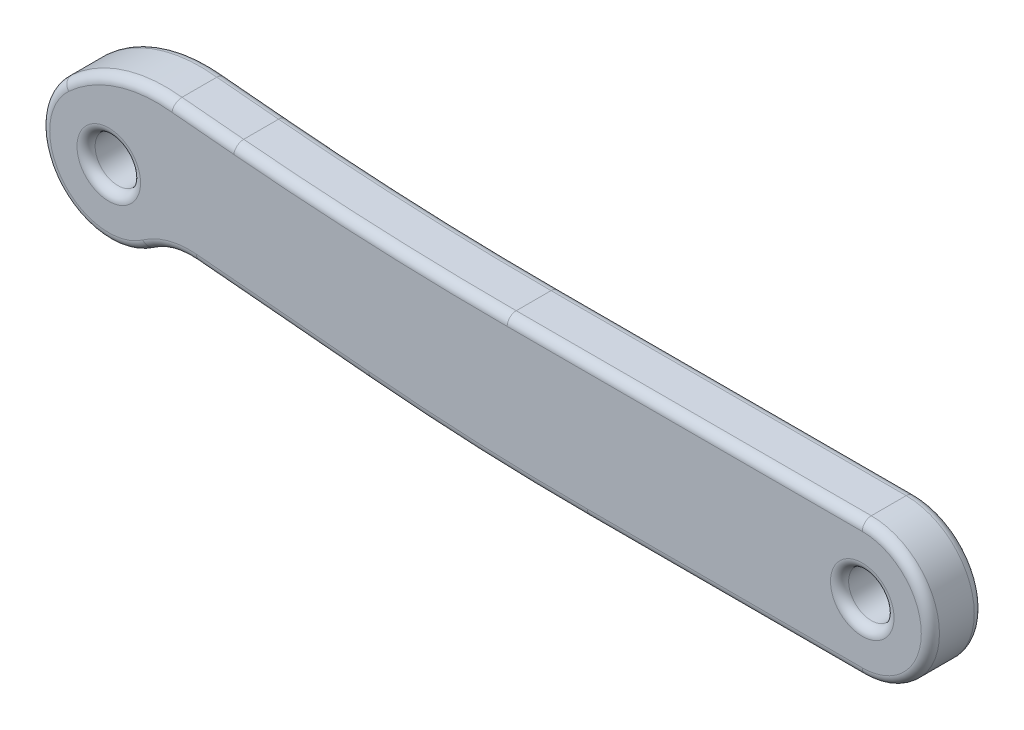
ISO-10303-21;
HEADER;
FILE_DESCRIPTION(('STEP AP214'),'2;1');
FILE_NAME('part.step','',(''),(''),'','','');
FILE_SCHEMA(('AUTOMOTIVE_DESIGN { 1 0 10303 214 1 1 1 1 }'));
ENDSEC;
DATA;
#1=APPLICATION_CONTEXT('core data for automotive mechanical design processes');
#2=APPLICATION_PROTOCOL_DEFINITION('international standard','automotive_design',2000,#1);
#3=PRODUCT_CONTEXT('',#1,'mechanical');
#4=PRODUCT('Part','Part','',(#3));
#5=PRODUCT_RELATED_PRODUCT_CATEGORY('part','',(#4));
#6=PRODUCT_DEFINITION_FORMATION('','',#4);
#7=PRODUCT_DEFINITION_CONTEXT('part definition',#1,'design');
#8=PRODUCT_DEFINITION('design','',#6,#7);
#9=PRODUCT_DEFINITION_SHAPE('','',#8);
#10=(LENGTH_UNIT() NAMED_UNIT(*) SI_UNIT(.MILLI.,.METRE.));
#11=(NAMED_UNIT(*) PLANE_ANGLE_UNIT() SI_UNIT($,.RADIAN.));
#12=(NAMED_UNIT(*) SI_UNIT($,.STERADIAN.) SOLID_ANGLE_UNIT());
#13=UNCERTAINTY_MEASURE_WITH_UNIT(LENGTH_MEASURE(1.E-05),#10,'distance_accuracy_value','');
#14=(GEOMETRIC_REPRESENTATION_CONTEXT(3) GLOBAL_UNCERTAINTY_ASSIGNED_CONTEXT((#13)) GLOBAL_UNIT_ASSIGNED_CONTEXT((#10,
#11,#12)) REPRESENTATION_CONTEXT('',''));
#15=CARTESIAN_POINT('',(0.,0.,0.));
#16=DIRECTION('',(0.,0.,1.));
#17=DIRECTION('',(1.,0.,0.));
#18=AXIS2_PLACEMENT_3D('',#15,#16,#17);
#19=CARTESIAN_POINT('',(0.,0.,1.75));
#20=DIRECTION('',(0.,0.,-1.));
#21=DIRECTION('',(-1.,0.,0.));
#22=AXIS2_PLACEMENT_3D('',#19,#20,#21);
#23=CYLINDRICAL_SURFACE('',#22,2.25);
#24=DIRECTION('',(0.,0.,1.));
#25=VECTOR('',#24,1.);
#26=CARTESIAN_POINT('',(-1.52467335470079,1.65465137157816,0.));
#27=LINE('',#26,#25);
#28=CARTESIAN_POINT('',(-1.52467335470079,1.65465137157816,0.3));
#29=VERTEX_POINT('',#28);
#30=CARTESIAN_POINT('',(-1.52467335470079,1.65465137157816,1.45));
#31=VERTEX_POINT('',#30);
#32=EDGE_CURVE('E458',#29,#31,#27,.T.);
#33=ORIENTED_EDGE('',*,*,#32,.F.);
#34=CARTESIAN_POINT('',(0.,0.,0.3));
#35=DIRECTION('',(0.,0.,1.));
#36=DIRECTION('',(1.,0.,0.));
#37=AXIS2_PLACEMENT_3D('',#34,#35,#36);
#38=CIRCLE('',#37,2.25);
#39=CARTESIAN_POINT('',(1.29610472523494,-1.83918801138537,0.3));
#40=VERTEX_POINT('',#39);
#41=EDGE_CURVE('E261',#29,#40,#38,.T.);
#42=ORIENTED_EDGE('',*,*,#41,.T.);
#43=DIRECTION('',(0.,0.,1.));
#44=VECTOR('',#43,1.);
#45=CARTESIAN_POINT('',(1.29610472523494,-1.83918801138537,0.));
#46=LINE('',#45,#44);
#47=CARTESIAN_POINT('',(1.29610472523494,-1.83918801138537,1.45));
#48=VERTEX_POINT('',#47);
#49=EDGE_CURVE('E405',#40,#48,#46,.T.);
#50=ORIENTED_EDGE('',*,*,#49,.T.);
#51=CARTESIAN_POINT('',(0.,0.,1.45));
#52=DIRECTION('',(0.,0.,1.));
#53=DIRECTION('',(1.,0.,0.));
#54=AXIS2_PLACEMENT_3D('',#51,#52,#53);
#55=CIRCLE('',#54,2.25);
#56=EDGE_CURVE('E259',#48,#31,#55,.F.);
#57=ORIENTED_EDGE('',*,*,#56,.T.);
#58=EDGE_LOOP('',(#33,#42,#50,#57));
#59=FACE_BOUND('',#58,.T.);
#60=ADVANCED_FACE('F34',(#59),#23,.T.);
#61=CARTESIAN_POINT('',(0.,2.25,1.75));
#62=DIRECTION('',(0.,-1.,0.));
#63=DIRECTION('',(0.,0.,-1.));
#64=AXIS2_PLACEMENT_3D('',#61,#62,#63);
#65=PLANE('',#64);
#66=DIRECTION('',(0.,0.,-1.));
#67=VECTOR('',#66,1.);
#68=CARTESIAN_POINT('',(24.89303825,2.25,1.75));
#69=LINE('',#68,#67);
#70=CARTESIAN_POINT('',(24.89303825,2.25,1.45));
#71=VERTEX_POINT('',#70);
#72=CARTESIAN_POINT('',(24.89303825,2.25,0.3));
#73=VERTEX_POINT('',#72);
#74=EDGE_CURVE('E403',#71,#73,#69,.T.);
#75=ORIENTED_EDGE('',*,*,#74,.T.);
#76=DIRECTION('',(-1.,0.,0.));
#77=VECTOR('',#76,1.);
#78=CARTESIAN_POINT('',(0.,2.25,0.3));
#79=LINE('',#78,#77);
#80=CARTESIAN_POINT('',(13.162158488708,2.25,0.3));
#81=VERTEX_POINT('',#80);
#82=EDGE_CURVE('E244',#73,#81,#79,.T.);
#83=ORIENTED_EDGE('',*,*,#82,.T.);
#84=DIRECTION('',(0.,0.,1.));
#85=VECTOR('',#84,1.);
#86=CARTESIAN_POINT('',(13.162158488708,2.25,0.));
#87=LINE('',#86,#85);
#88=CARTESIAN_POINT('',(13.162158488708,2.25,1.45));
#89=VERTEX_POINT('',#88);
#90=EDGE_CURVE('E475',#81,#89,#87,.T.);
#91=ORIENTED_EDGE('',*,*,#90,.T.);
#92=DIRECTION('',(-1.,0.,0.));
#93=VECTOR('',#92,1.);
#94=CARTESIAN_POINT('',(24.89303825,2.25,1.45));
#95=LINE('',#94,#93);
#96=EDGE_CURVE('E242',#89,#71,#95,.F.);
#97=ORIENTED_EDGE('',*,*,#96,.T.);
#98=EDGE_LOOP('',(#75,#83,#91,#97));
#99=FACE_BOUND('',#98,.T.);
#100=ADVANCED_FACE('F479',(#99),#65,.F.);
#101=CARTESIAN_POINT('',(0.,-2.25,1.75));
#102=DIRECTION('',(0.,1.,0.));
#103=DIRECTION('',(0.,0.,1.));
#104=AXIS2_PLACEMENT_3D('',#101,#102,#103);
#105=PLANE('',#104);
#106=DIRECTION('',(0.,0.,1.));
#107=VECTOR('',#106,1.);
#108=CARTESIAN_POINT('',(15.8071767602875,-2.25000000000006,0.));
#109=LINE('',#108,#107);
#110=CARTESIAN_POINT('',(15.8071767602875,-2.25000000000006,0.3));
#111=VERTEX_POINT('',#110);
#112=CARTESIAN_POINT('',(15.8071767602875,-2.25000000000006,1.45));
#113=VERTEX_POINT('',#112);
#114=EDGE_CURVE('E395',#111,#113,#109,.T.);
#115=ORIENTED_EDGE('',*,*,#114,.F.);
#116=DIRECTION('',(1.,0.,0.));
#117=VECTOR('',#116,1.);
#118=CARTESIAN_POINT('',(0.,-2.25,0.3));
#119=LINE('',#118,#117);
#120=CARTESIAN_POINT('',(24.89303825,-2.25,0.3));
#121=VERTEX_POINT('',#120);
#122=EDGE_CURVE('E236',#111,#121,#119,.T.);
#123=ORIENTED_EDGE('',*,*,#122,.T.);
#124=DIRECTION('',(0.,0.,-1.));
#125=VECTOR('',#124,1.);
#126=CARTESIAN_POINT('',(24.89303825,-2.25,1.75));
#127=LINE('',#126,#125);
#128=CARTESIAN_POINT('',(24.89303825,-2.25,1.45));
#129=VERTEX_POINT('',#128);
#130=EDGE_CURVE('E195',#129,#121,#127,.T.);
#131=ORIENTED_EDGE('',*,*,#130,.F.);
#132=DIRECTION('',(1.,0.,0.));
#133=VECTOR('',#132,1.);
#134=CARTESIAN_POINT('',(15.8071767602875,-2.25,1.45));
#135=LINE('',#134,#133);
#136=EDGE_CURVE('E234',#129,#113,#135,.F.);
#137=ORIENTED_EDGE('',*,*,#136,.T.);
#138=EDGE_LOOP('',(#115,#123,#131,#137));
#139=FACE_BOUND('',#138,.T.);
#140=ADVANCED_FACE('F495',(#139),#105,.F.);
#141=CARTESIAN_POINT('',(0.,0.,1.75));
#142=DIRECTION('',(0.,0.,1.));
#143=DIRECTION('',(1.,0.,0.));
#144=AXIS2_PLACEMENT_3D('',#141,#142,#143);
#145=PLANE('',#144);
#146=CARTESIAN_POINT('',(24.89303825,0.,1.75));
#147=DIRECTION('',(0.,0.,1.));
#148=DIRECTION('',(1.,0.,0.));
#149=AXIS2_PLACEMENT_3D('',#146,#147,#148);
#150=CIRCLE('',#149,1.05);
#151=CARTESIAN_POINT('',(25.94303825,0.,1.75));
#152=VERTEX_POINT('',#151);
#153=EDGE_CURVE('E12',#152,#152,#150,.F.);
#154=ORIENTED_EDGE('',*,*,#153,.T.);
#155=EDGE_LOOP('',(#154));
#156=FACE_BOUND('',#155,.T.);
#157=CARTESIAN_POINT('',(0.,0.,1.75));
#158=DIRECTION('',(0.,0.,1.));
#159=DIRECTION('',(1.,0.,0.));
#160=AXIS2_PLACEMENT_3D('',#157,#158,#159);
#161=CIRCLE('',#160,1.05);
#162=CARTESIAN_POINT('',(1.05,0.,1.75));
#163=VERTEX_POINT('',#162);
#164=EDGE_CURVE('E43',#163,#163,#161,.F.);
#165=ORIENTED_EDGE('',*,*,#164,.T.);
#166=EDGE_LOOP('',(#165));
#167=FACE_BOUND('',#166,.T.);
#168=CARTESIAN_POINT('',(13.162158488708,102.934591607014,1.75));
#169=DIRECTION('',(0.,0.,1.));
#170=DIRECTION('',(1.,0.,0.));
#171=AXIS2_PLACEMENT_3D('',#168,#169,#170);
#172=CIRCLE('',#171,100.984591607014);
#173=CARTESIAN_POINT('',(13.162158488708,1.95,1.75));
#174=VERTEX_POINT('',#173);
#175=CARTESIAN_POINT('',(4.1328255389998,2.35447981288885,1.75));
#176=VERTEX_POINT('',#175);
#177=EDGE_CURVE('E51',#174,#176,#172,.F.);
#178=ORIENTED_EDGE('',*,*,#177,.T.);
#179=DIRECTION('',(-0.995994638325983,0.0894129768316409,0.));
#180=VECTOR('',#179,1.);
#181=CARTESIAN_POINT('',(0.242718455459598,2.70370463915676,1.75));
#182=LINE('',#181,#180);
#183=CARTESIAN_POINT('',(2.09015922776099,2.53785517309011,1.75));
#184=VERTEX_POINT('',#183);
#185=EDGE_CURVE('E279',#176,#184,#182,.T.);
#186=ORIENTED_EDGE('',*,*,#185,.T.);
#187=CARTESIAN_POINT('',(1.58269722959737,-1.71762176709653,1.75));
#188=DIRECTION('',(0.,0.,1.));
#189=DIRECTION('',(1.,0.,0.));
#190=AXIS2_PLACEMENT_3D('',#187,#188,#189);
#191=CIRCLE('',#190,4.28562733657985);
#192=CARTESIAN_POINT('',(-1.32138357407402,1.43403118870108,1.75));
#193=VERTEX_POINT('',#192);
#194=EDGE_CURVE('E263',#184,#193,#191,.T.);
#195=ORIENTED_EDGE('',*,*,#194,.T.);
#196=CARTESIAN_POINT('',(0.,0.,1.75));
#197=DIRECTION('',(0.,0.,1.));
#198=DIRECTION('',(1.,0.,0.));
#199=AXIS2_PLACEMENT_3D('',#196,#197,#198);
#200=CIRCLE('',#199,1.95);
#201=CARTESIAN_POINT('',(1.12329076187028,-1.59396294320065,1.75));
#202=VERTEX_POINT('',#201);
#203=EDGE_CURVE('E265',#193,#202,#200,.T.);
#204=ORIENTED_EDGE('',*,*,#203,.T.);
#205=CARTESIAN_POINT('',(2.66557638606268,-3.78248457646024,1.75));
#206=DIRECTION('',(0.,0.,1.));
#207=DIRECTION('',(1.,0.,0.));
#208=AXIS2_PLACEMENT_3D('',#205,#206,#207);
#209=CIRCLE('',#208,2.67736286032277);
#210=CARTESIAN_POINT('',(2.90496736946259,-1.11584552272564,1.75));
#211=VERTEX_POINT('',#210);
#212=EDGE_CURVE('E267',#202,#211,#209,.F.);
#213=ORIENTED_EDGE('',*,*,#212,.T.);
#214=DIRECTION('',(0.995994638325983,-0.0894129768316325,0.));
#215=VECTOR('',#214,1.);
#216=CARTESIAN_POINT('',(-0.0761471648852078,-0.848223274035544,1.75));
#217=LINE('',#216,#215);
#218=CARTESIAN_POINT('',(8.60095043109571,-1.62718843756218,1.75));
#219=VERTEX_POINT('',#218);
#220=EDGE_CURVE('E269',#211,#219,#217,.T.);
#221=ORIENTED_EDGE('',*,*,#220,.T.);
#222=CARTESIAN_POINT('',(15.8071767602885,78.6448597680787,1.75));
#223=DIRECTION('',(0.,0.,1.));
#224=DIRECTION('',(1.,0.,0.));
#225=AXIS2_PLACEMENT_3D('',#222,#223,#224);
#226=CIRCLE('',#225,80.5948597680787);
#227=CARTESIAN_POINT('',(15.8071767602875,-1.95000000000006,1.75));
#228=VERTEX_POINT('',#227);
#229=EDGE_CURVE('E271',#219,#228,#226,.T.);
#230=ORIENTED_EDGE('',*,*,#229,.T.);
#231=DIRECTION('',(1.,0.,0.));
#232=VECTOR('',#231,1.);
#233=CARTESIAN_POINT('',(24.89303825,-1.95,1.75));
#234=LINE('',#233,#232);
#235=CARTESIAN_POINT('',(24.89303825,-1.95,1.75));
#236=VERTEX_POINT('',#235);
#237=EDGE_CURVE('E273',#228,#236,#234,.T.);
#238=ORIENTED_EDGE('',*,*,#237,.T.);
#239=CARTESIAN_POINT('',(24.89303825,0.,1.75));
#240=DIRECTION('',(0.,0.,1.));
#241=DIRECTION('',(1.,0.,0.));
#242=AXIS2_PLACEMENT_3D('',#239,#240,#241);
#243=CIRCLE('',#242,1.95);
#244=CARTESIAN_POINT('',(24.89303825,1.95,1.75));
#245=VERTEX_POINT('',#244);
#246=EDGE_CURVE('E275',#236,#245,#243,.T.);
#247=ORIENTED_EDGE('',*,*,#246,.T.);
#248=DIRECTION('',(-1.,0.,0.));
#249=VECTOR('',#248,1.);
#250=CARTESIAN_POINT('',(13.162158488708,1.95,1.75));
#251=LINE('',#250,#249);
#252=EDGE_CURVE('E56',#245,#174,#251,.T.);
#253=ORIENTED_EDGE('',*,*,#252,.T.);
#254=EDGE_LOOP('',(#178,#186,#195,#204,#213,#221,#230,#238,#247,#253));
#255=FACE_BOUND('',#254,.T.);
#256=ADVANCED_FACE('F719',(#156,#167,#255),#145,.T.);
#257=CARTESIAN_POINT('',(0.,0.,0.));
#258=DIRECTION('',(0.,0.,1.));
#259=DIRECTION('',(1.,0.,0.));
#260=AXIS2_PLACEMENT_3D('',#257,#258,#259);
#261=PLANE('',#260);
#262=CARTESIAN_POINT('',(24.89303825,0.,0.));
#263=DIRECTION('',(0.,0.,1.));
#264=DIRECTION('',(1.,0.,0.));
#265=AXIS2_PLACEMENT_3D('',#262,#263,#264);
#266=CIRCLE('',#265,1.05);
#267=CARTESIAN_POINT('',(25.94303825,0.,0.));
#268=VERTEX_POINT('',#267);
#269=EDGE_CURVE('E203',#268,#268,#266,.T.);
#270=ORIENTED_EDGE('',*,*,#269,.T.);
#271=EDGE_LOOP('',(#270));
#272=FACE_BOUND('',#271,.T.);
#273=CARTESIAN_POINT('',(0.,0.,0.));
#274=DIRECTION('',(0.,0.,1.));
#275=DIRECTION('',(1.,0.,0.));
#276=AXIS2_PLACEMENT_3D('',#273,#274,#275);
#277=CIRCLE('',#276,1.05);
#278=CARTESIAN_POINT('',(1.05,0.,0.));
#279=VERTEX_POINT('',#278);
#280=EDGE_CURVE('E200',#279,#279,#277,.T.);
#281=ORIENTED_EDGE('',*,*,#280,.T.);
#282=EDGE_LOOP('',(#281));
#283=FACE_BOUND('',#282,.T.);
#284=DIRECTION('',(0.995994638325983,-0.0894129768316325,0.));
#285=VECTOR('',#284,1.);
#286=CARTESIAN_POINT('',(2.90496736946259,-1.11584552272564,0.));
#287=LINE('',#286,#285);
#288=CARTESIAN_POINT('',(8.60095043109571,-1.62718843756216,0.));
#289=VERTEX_POINT('',#288);
#290=CARTESIAN_POINT('',(2.90496736946259,-1.11584552272564,0.));
#291=VERTEX_POINT('',#290);
#292=EDGE_CURVE('E199',#289,#291,#287,.F.);
#293=ORIENTED_EDGE('',*,*,#292,.T.);
#294=CARTESIAN_POINT('',(2.66557638606268,-3.78248457646024,0.));
#295=DIRECTION('',(0.,0.,1.));
#296=DIRECTION('',(1.,0.,0.));
#297=AXIS2_PLACEMENT_3D('',#294,#295,#296);
#298=CIRCLE('',#297,2.67736286032277);
#299=CARTESIAN_POINT('',(1.12329076187028,-1.59396294320065,0.));
#300=VERTEX_POINT('',#299);
#301=EDGE_CURVE('E178',#291,#300,#298,.T.);
#302=ORIENTED_EDGE('',*,*,#301,.T.);
#303=CARTESIAN_POINT('',(0.,0.,0.));
#304=DIRECTION('',(0.,0.,1.));
#305=DIRECTION('',(1.,0.,0.));
#306=AXIS2_PLACEMENT_3D('',#303,#304,#305);
#307=CIRCLE('',#306,1.95);
#308=CARTESIAN_POINT('',(-1.32138357407401,1.43403118870107,0.));
#309=VERTEX_POINT('',#308);
#310=EDGE_CURVE('E188',#300,#309,#307,.F.);
#311=ORIENTED_EDGE('',*,*,#310,.T.);
#312=CARTESIAN_POINT('',(1.58269722959737,-1.71762176709653,0.));
#313=DIRECTION('',(0.,0.,1.));
#314=DIRECTION('',(1.,0.,0.));
#315=AXIS2_PLACEMENT_3D('',#312,#313,#314);
#316=CIRCLE('',#315,4.28562733657985);
#317=CARTESIAN_POINT('',(2.090159227761,2.53785517309011,0.));
#318=VERTEX_POINT('',#317);
#319=EDGE_CURVE('E194',#309,#318,#316,.F.);
#320=ORIENTED_EDGE('',*,*,#319,.T.);
#321=DIRECTION('',(-0.995994638325983,0.0894129768316409,0.));
#322=VECTOR('',#321,1.);
#323=CARTESIAN_POINT('',(4.13282553899979,2.35447981288883,0.));
#324=LINE('',#323,#322);
#325=CARTESIAN_POINT('',(4.1328255389998,2.35447981288883,0.));
#326=VERTEX_POINT('',#325);
#327=EDGE_CURVE('E417',#318,#326,#324,.F.);
#328=ORIENTED_EDGE('',*,*,#327,.T.);
#329=CARTESIAN_POINT('',(13.162158488708,102.934591607014,0.));
#330=DIRECTION('',(0.,0.,1.));
#331=DIRECTION('',(1.,0.,0.));
#332=AXIS2_PLACEMENT_3D('',#329,#330,#331);
#333=CIRCLE('',#332,100.984591607014);
#334=CARTESIAN_POINT('',(13.162158488708,1.95,0.));
#335=VERTEX_POINT('',#334);
#336=EDGE_CURVE('E419',#326,#335,#333,.T.);
#337=ORIENTED_EDGE('',*,*,#336,.T.);
#338=DIRECTION('',(-1.,0.,0.));
#339=VECTOR('',#338,1.);
#340=CARTESIAN_POINT('',(0.,1.95,0.));
#341=LINE('',#340,#339);
#342=CARTESIAN_POINT('',(24.89303825,1.95,0.));
#343=VERTEX_POINT('',#342);
#344=EDGE_CURVE('E421',#335,#343,#341,.F.);
#345=ORIENTED_EDGE('',*,*,#344,.T.);
#346=CARTESIAN_POINT('',(24.89303825,0.,0.));
#347=DIRECTION('',(0.,0.,1.));
#348=DIRECTION('',(1.,0.,0.));
#349=AXIS2_PLACEMENT_3D('',#346,#347,#348);
#350=CIRCLE('',#349,1.95);
#351=CARTESIAN_POINT('',(24.89303825,-1.95,0.));
#352=VERTEX_POINT('',#351);
#353=EDGE_CURVE('E423',#343,#352,#350,.F.);
#354=ORIENTED_EDGE('',*,*,#353,.T.);
#355=DIRECTION('',(1.,0.,0.));
#356=VECTOR('',#355,1.);
#357=CARTESIAN_POINT('',(0.,-1.95,0.));
#358=LINE('',#357,#356);
#359=CARTESIAN_POINT('',(15.8071767602875,-1.95,0.));
#360=VERTEX_POINT('',#359);
#361=EDGE_CURVE('E425',#352,#360,#358,.F.);
#362=ORIENTED_EDGE('',*,*,#361,.T.);
#363=CARTESIAN_POINT('',(15.8071767602885,78.6448597680787,0.));
#364=DIRECTION('',(0.,0.,1.));
#365=DIRECTION('',(1.,0.,0.));
#366=AXIS2_PLACEMENT_3D('',#363,#364,#365);
#367=CIRCLE('',#366,80.5948597680787);
#368=EDGE_CURVE('E205',#360,#289,#367,.F.);
#369=ORIENTED_EDGE('',*,*,#368,.T.);
#370=EDGE_LOOP('',(#293,#302,#311,#320,#328,#337,#345,#354,#362,#369));
#371=FACE_BOUND('',#370,.T.);
#372=ADVANCED_FACE('F197',(#272,#283,#371),#261,.F.);
#373=CARTESIAN_POINT('',(24.89303825,0.,1.75));
#374=DIRECTION('',(0.,0.,-1.));
#375=DIRECTION('',(-1.,0.,0.));
#376=AXIS2_PLACEMENT_3D('',#373,#374,#375);
#377=CYLINDRICAL_SURFACE('',#376,2.25);
#378=ORIENTED_EDGE('',*,*,#130,.T.);
#379=CARTESIAN_POINT('',(24.89303825,0.,0.3));
#380=DIRECTION('',(0.,0.,1.));
#381=DIRECTION('',(1.,0.,0.));
#382=AXIS2_PLACEMENT_3D('',#379,#380,#381);
#383=CIRCLE('',#382,2.25);
#384=EDGE_CURVE('E240',#121,#73,#383,.T.);
#385=ORIENTED_EDGE('',*,*,#384,.T.);
#386=ORIENTED_EDGE('',*,*,#74,.F.);
#387=CARTESIAN_POINT('',(24.89303825,0.,1.45));
#388=DIRECTION('',(0.,0.,1.));
#389=DIRECTION('',(1.,0.,0.));
#390=AXIS2_PLACEMENT_3D('',#387,#388,#389);
#391=CIRCLE('',#390,2.25);
#392=EDGE_CURVE('E238',#71,#129,#391,.F.);
#393=ORIENTED_EDGE('',*,*,#392,.T.);
#394=EDGE_LOOP('',(#378,#385,#386,#393));
#395=FACE_BOUND('',#394,.T.);
#396=ADVANCED_FACE('F492',(#395),#377,.T.);
#397=CARTESIAN_POINT('',(0.,0.,1.75));
#398=DIRECTION('',(0.,0.,-1.));
#399=DIRECTION('',(-1.,0.,0.));
#400=AXIS2_PLACEMENT_3D('',#397,#398,#399);
#401=CYLINDRICAL_SURFACE('',#400,0.75);
#402=CARTESIAN_POINT('',(0.,0.,0.3));
#403=DIRECTION('',(0.,0.,1.));
#404=DIRECTION('',(1.,0.,0.));
#405=AXIS2_PLACEMENT_3D('',#402,#403,#404);
#406=CIRCLE('',#405,0.75);
#407=CARTESIAN_POINT('',(0.75,0.,0.3));
#408=VERTEX_POINT('',#407);
#409=EDGE_CURVE('E220',#408,#408,#406,.F.);
#410=ORIENTED_EDGE('',*,*,#409,.T.);
#411=EDGE_LOOP('',(#410));
#412=FACE_BOUND('',#411,.T.);
#413=CARTESIAN_POINT('',(0.,0.,1.45));
#414=DIRECTION('',(0.,0.,1.));
#415=DIRECTION('',(1.,0.,0.));
#416=AXIS2_PLACEMENT_3D('',#413,#414,#415);
#417=CIRCLE('',#416,0.75);
#418=CARTESIAN_POINT('',(0.75,0.,1.45));
#419=VERTEX_POINT('',#418);
#420=EDGE_CURVE('E217',#419,#419,#417,.T.);
#421=ORIENTED_EDGE('',*,*,#420,.T.);
#422=EDGE_LOOP('',(#421));
#423=FACE_BOUND('',#422,.T.);
#424=ADVANCED_FACE('F765',(#412,#423),#401,.F.);
#425=CARTESIAN_POINT('',(24.89303825,0.,1.75));
#426=DIRECTION('',(0.,0.,-1.));
#427=DIRECTION('',(-1.,0.,0.));
#428=AXIS2_PLACEMENT_3D('',#425,#426,#427);
#429=CYLINDRICAL_SURFACE('',#428,0.750000000000002);
#430=CARTESIAN_POINT('',(24.89303825,0.,0.3));
#431=DIRECTION('',(0.,0.,1.));
#432=DIRECTION('',(1.,0.,0.));
#433=AXIS2_PLACEMENT_3D('',#430,#431,#432);
#434=CIRCLE('',#433,0.750000000000002);
#435=CARTESIAN_POINT('',(25.64303825,0.,0.3));
#436=VERTEX_POINT('',#435);
#437=EDGE_CURVE('E214',#436,#436,#434,.F.);
#438=ORIENTED_EDGE('',*,*,#437,.T.);
#439=EDGE_LOOP('',(#438));
#440=FACE_BOUND('',#439,.T.);
#441=CARTESIAN_POINT('',(24.89303825,0.,1.45));
#442=DIRECTION('',(0.,0.,1.));
#443=DIRECTION('',(1.,0.,0.));
#444=AXIS2_PLACEMENT_3D('',#441,#442,#443);
#445=CIRCLE('',#444,0.750000000000002);
#446=CARTESIAN_POINT('',(25.64303825,0.,1.45));
#447=VERTEX_POINT('',#446);
#448=EDGE_CURVE('E211',#447,#447,#445,.T.);
#449=ORIENTED_EDGE('',*,*,#448,.T.);
#450=EDGE_LOOP('',(#449));
#451=FACE_BOUND('',#450,.T.);
#452=ADVANCED_FACE('F770',(#440,#451),#429,.F.);
#453=CARTESIAN_POINT('',(15.8071767602885,78.6448597680787,0.));
#454=DIRECTION('',(0.,0.,1.));
#455=DIRECTION('',(1.,0.,0.));
#456=AXIS2_PLACEMENT_3D('',#453,#454,#455);
#457=CYLINDRICAL_SURFACE('',#456,80.8948597680787);
#458=DIRECTION('',(0.,0.,1.));
#459=VECTOR('',#458,1.);
#460=CARTESIAN_POINT('',(8.57412653804622,-1.92598682905998,0.));
#461=LINE('',#460,#459);
#462=CARTESIAN_POINT('',(8.57412653804622,-1.92598682905998,0.3));
#463=VERTEX_POINT('',#462);
#464=CARTESIAN_POINT('',(8.57412653804622,-1.92598682905998,1.45));
#465=VERTEX_POINT('',#464);
#466=EDGE_CURVE('E392',#463,#465,#461,.T.);
#467=ORIENTED_EDGE('',*,*,#466,.F.);
#468=CARTESIAN_POINT('',(15.8071767602885,78.6448597680787,0.3));
#469=DIRECTION('',(0.,0.,1.));
#470=DIRECTION('',(1.,0.,0.));
#471=AXIS2_PLACEMENT_3D('',#468,#469,#470);
#472=CIRCLE('',#471,80.8948597680787);
#473=EDGE_CURVE('E232',#463,#111,#472,.T.);
#474=ORIENTED_EDGE('',*,*,#473,.T.);
#475=ORIENTED_EDGE('',*,*,#114,.T.);
#476=CARTESIAN_POINT('',(15.8071767602885,78.6448597680787,1.45));
#477=DIRECTION('',(0.,0.,1.));
#478=DIRECTION('',(1.,0.,0.));
#479=AXIS2_PLACEMENT_3D('',#476,#477,#478);
#480=CIRCLE('',#479,80.8948597680787);
#481=EDGE_CURVE('E230',#113,#465,#480,.F.);
#482=ORIENTED_EDGE('',*,*,#481,.T.);
#483=EDGE_LOOP('',(#467,#474,#475,#482));
#484=FACE_BOUND('',#483,.T.);
#485=ADVANCED_FACE('F391',(#484),#457,.T.);
#486=CARTESIAN_POINT('',(2.8781434764131,-1.41464391422344,0.));
#487=DIRECTION('',(-0.0894129768316325,-0.995994638325983,0.));
#488=DIRECTION('',(0.995994638325983,-0.0894129768316325,0.));
#489=AXIS2_PLACEMENT_3D('',#486,#487,#488);
#490=PLANE('',#489);
#491=DIRECTION('',(0.,0.,1.));
#492=VECTOR('',#491,1.);
#493=CARTESIAN_POINT('',(2.8781434764131,-1.41464391422344,0.));
#494=LINE('',#493,#492);
#495=CARTESIAN_POINT('',(2.8781434764131,-1.41464391422344,0.3));
#496=VERTEX_POINT('',#495);
#497=CARTESIAN_POINT('',(2.8781434764131,-1.41464391422344,1.45));
#498=VERTEX_POINT('',#497);
#499=EDGE_CURVE('E401',#496,#498,#494,.T.);
#500=ORIENTED_EDGE('',*,*,#499,.F.);
#501=DIRECTION('',(0.995994638325983,-0.0894129768316325,0.));
#502=VECTOR('',#501,1.);
#503=CARTESIAN_POINT('',(8.57412653804622,-1.92598682905998,0.3));
#504=LINE('',#503,#502);
#505=EDGE_CURVE('E228',#496,#463,#504,.T.);
#506=ORIENTED_EDGE('',*,*,#505,.T.);
#507=ORIENTED_EDGE('',*,*,#466,.T.);
#508=DIRECTION('',(0.995994638325983,-0.0894129768316325,0.));
#509=VECTOR('',#508,1.);
#510=CARTESIAN_POINT('',(2.8781434764131,-1.41464391422344,1.45));
#511=LINE('',#510,#509);
#512=EDGE_CURVE('E226',#465,#498,#511,.F.);
#513=ORIENTED_EDGE('',*,*,#512,.T.);
#514=EDGE_LOOP('',(#500,#506,#507,#513));
#515=FACE_BOUND('',#514,.T.);
#516=ADVANCED_FACE('F398',(#515),#490,.T.);
#517=CARTESIAN_POINT('',(2.66557638606268,-3.78248457646024,0.));
#518=DIRECTION('',(0.,0.,1.));
#519=DIRECTION('',(1.,0.,0.));
#520=AXIS2_PLACEMENT_3D('',#517,#518,#519);
#521=CYLINDRICAL_SURFACE('',#520,2.37736286032277);
#522=ORIENTED_EDGE('',*,*,#49,.F.);
#523=CARTESIAN_POINT('',(2.66557638606268,-3.78248457646024,0.3));
#524=DIRECTION('',(0.,0.,1.));
#525=DIRECTION('',(1.,0.,0.));
#526=AXIS2_PLACEMENT_3D('',#523,#524,#525);
#527=CIRCLE('',#526,2.37736286032277);
#528=EDGE_CURVE('E181',#40,#496,#527,.F.);
#529=ORIENTED_EDGE('',*,*,#528,.T.);
#530=ORIENTED_EDGE('',*,*,#499,.T.);
#531=CARTESIAN_POINT('',(2.66557638606268,-3.78248457646024,1.45));
#532=DIRECTION('',(0.,0.,1.));
#533=DIRECTION('',(1.,0.,0.));
#534=AXIS2_PLACEMENT_3D('',#531,#532,#533);
#535=CIRCLE('',#534,2.37736286032277);
#536=EDGE_CURVE('E223',#498,#48,#535,.T.);
#537=ORIENTED_EDGE('',*,*,#536,.T.);
#538=EDGE_LOOP('',(#522,#529,#530,#537));
#539=FACE_BOUND('',#538,.T.);
#540=ADVANCED_FACE('F435',(#539),#521,.F.);
#541=CARTESIAN_POINT('',(1.58269722959737,-1.71762176709653,0.));
#542=DIRECTION('',(0.,0.,1.));
#543=DIRECTION('',(1.,0.,0.));
#544=AXIS2_PLACEMENT_3D('',#541,#542,#543);
#545=CYLINDRICAL_SURFACE('',#544,4.58562733657985);
#546=DIRECTION('',(0.,0.,1.));
#547=VECTOR('',#546,1.);
#548=CARTESIAN_POINT('',(2.1212656371183,2.83626911218558,0.));
#549=LINE('',#548,#547);
#550=CARTESIAN_POINT('',(2.1212656371183,2.83626911218558,0.3));
#551=VERTEX_POINT('',#550);
#552=CARTESIAN_POINT('',(2.1212656371183,2.83626911218558,1.45));
#553=VERTEX_POINT('',#552);
#554=EDGE_CURVE('E411',#551,#553,#549,.T.);
#555=ORIENTED_EDGE('',*,*,#554,.F.);
#556=CARTESIAN_POINT('',(1.58269722959737,-1.71762176709653,0.3));
#557=DIRECTION('',(0.,0.,1.));
#558=DIRECTION('',(1.,0.,0.));
#559=AXIS2_PLACEMENT_3D('',#556,#557,#558);
#560=CIRCLE('',#559,4.58562733657985);
#561=EDGE_CURVE('E257',#551,#29,#560,.T.);
#562=ORIENTED_EDGE('',*,*,#561,.T.);
#563=ORIENTED_EDGE('',*,*,#32,.T.);
#564=CARTESIAN_POINT('',(1.58269722959737,-1.71762176709653,1.45));
#565=DIRECTION('',(0.,0.,1.));
#566=DIRECTION('',(1.,0.,0.));
#567=AXIS2_PLACEMENT_3D('',#564,#565,#566);
#568=CIRCLE('',#567,4.58562733657985);
#569=EDGE_CURVE('E255',#31,#553,#568,.F.);
#570=ORIENTED_EDGE('',*,*,#569,.T.);
#571=EDGE_LOOP('',(#555,#562,#563,#570));
#572=FACE_BOUND('',#571,.T.);
#573=ADVANCED_FACE('F456',(#572),#545,.T.);
#574=CARTESIAN_POINT('',(2.1212656371183,2.83626911218558,0.));
#575=DIRECTION('',(0.0894129768316409,0.995994638325982,0.));
#576=DIRECTION('',(-0.995994638325983,0.0894129768316409,0.));
#577=AXIS2_PLACEMENT_3D('',#574,#575,#576);
#578=PLANE('',#577);
#579=DIRECTION('',(0.,0.,1.));
#580=VECTOR('',#579,1.);
#581=CARTESIAN_POINT('',(4.15964943204929,2.65327820438663,0.));
#582=LINE('',#581,#580);
#583=CARTESIAN_POINT('',(4.15964943204929,2.65327820438663,0.3));
#584=VERTEX_POINT('',#583);
#585=CARTESIAN_POINT('',(4.15964943204929,2.65327820438663,1.45));
#586=VERTEX_POINT('',#585);
#587=EDGE_CURVE('E465',#584,#586,#582,.T.);
#588=ORIENTED_EDGE('',*,*,#587,.F.);
#589=DIRECTION('',(-0.995994638325983,0.0894129768316409,0.));
#590=VECTOR('',#589,1.);
#591=CARTESIAN_POINT('',(2.1212656371183,2.83626911218558,0.3));
#592=LINE('',#591,#590);
#593=EDGE_CURVE('E253',#584,#551,#592,.T.);
#594=ORIENTED_EDGE('',*,*,#593,.T.);
#595=ORIENTED_EDGE('',*,*,#554,.T.);
#596=DIRECTION('',(-0.995994638325983,0.0894129768316409,0.));
#597=VECTOR('',#596,1.);
#598=CARTESIAN_POINT('',(2.1212656371183,2.83626911218558,1.45));
#599=LINE('',#598,#597);
#600=EDGE_CURVE('E250',#553,#586,#599,.F.);
#601=ORIENTED_EDGE('',*,*,#600,.T.);
#602=EDGE_LOOP('',(#588,#594,#595,#601));
#603=FACE_BOUND('',#602,.T.);
#604=ADVANCED_FACE('F462',(#603),#578,.T.);
#605=CARTESIAN_POINT('',(13.162158488708,102.934591607014,0.));
#606=DIRECTION('',(0.,0.,1.));
#607=DIRECTION('',(1.,0.,0.));
#608=AXIS2_PLACEMENT_3D('',#605,#606,#607);
#609=CYLINDRICAL_SURFACE('',#608,100.684591607014);
#610=ORIENTED_EDGE('',*,*,#90,.F.);
#611=CARTESIAN_POINT('',(13.162158488708,102.934591607014,0.3));
#612=DIRECTION('',(0.,0.,1.));
#613=DIRECTION('',(1.,0.,0.));
#614=AXIS2_PLACEMENT_3D('',#611,#612,#613);
#615=CIRCLE('',#614,100.684591607014);
#616=EDGE_CURVE('E248',#81,#584,#615,.F.);
#617=ORIENTED_EDGE('',*,*,#616,.T.);
#618=ORIENTED_EDGE('',*,*,#587,.T.);
#619=CARTESIAN_POINT('',(13.162158488708,102.934591607014,1.45));
#620=DIRECTION('',(0.,0.,1.));
#621=DIRECTION('',(1.,0.,0.));
#622=AXIS2_PLACEMENT_3D('',#619,#620,#621);
#623=CIRCLE('',#622,100.684591607014);
#624=EDGE_CURVE('E246',#586,#89,#623,.T.);
#625=ORIENTED_EDGE('',*,*,#624,.T.);
#626=EDGE_LOOP('',(#610,#617,#618,#625));
#627=FACE_BOUND('',#626,.T.);
#628=ADVANCED_FACE('F474',(#627),#609,.F.);
#629=CARTESIAN_POINT('',(24.89303825,0.,0.3));
#630=DIRECTION('',(0.,0.,1.));
#631=DIRECTION('',(1.,0.,0.));
#632=AXIS2_PLACEMENT_3D('',#629,#630,#631);
#633=TOROIDAL_SURFACE('',#632,1.05,0.3);
#634=ORIENTED_EDGE('',*,*,#437,.F.);
#635=EDGE_LOOP('',(#634));
#636=FACE_BOUND('',#635,.T.);
#637=ORIENTED_EDGE('',*,*,#269,.F.);
#638=EDGE_LOOP('',(#637));
#639=FACE_BOUND('',#638,.T.);
#640=ADVANCED_FACE('F526',(#636,#639),#633,.T.);
#641=CARTESIAN_POINT('',(0.,0.,0.3));
#642=DIRECTION('',(0.,0.,1.));
#643=DIRECTION('',(1.,0.,0.));
#644=AXIS2_PLACEMENT_3D('',#641,#642,#643);
#645=TOROIDAL_SURFACE('',#644,1.05,0.3);
#646=ORIENTED_EDGE('',*,*,#409,.F.);
#647=EDGE_LOOP('',(#646));
#648=FACE_BOUND('',#647,.T.);
#649=ORIENTED_EDGE('',*,*,#280,.F.);
#650=EDGE_LOOP('',(#649));
#651=FACE_BOUND('',#650,.T.);
#652=ADVANCED_FACE('F324',(#648,#651),#645,.T.);
#653=CARTESIAN_POINT('',(0.,1.95,0.3));
#654=DIRECTION('',(-1.,0.,0.));
#655=DIRECTION('',(0.,0.,1.));
#656=AXIS2_PLACEMENT_3D('',#653,#654,#655);
#657=CYLINDRICAL_SURFACE('',#656,0.3);
#658=CARTESIAN_POINT('',(24.89303825,1.95,0.3));
#659=DIRECTION('',(1.,0.,0.));
#660=DIRECTION('',(0.,0.,-1.));
#661=AXIS2_PLACEMENT_3D('',#658,#659,#660);
#662=CIRCLE('',#661,0.3);
#663=EDGE_CURVE('E502',#343,#73,#662,.T.);
#664=ORIENTED_EDGE('',*,*,#663,.F.);
#665=ORIENTED_EDGE('',*,*,#344,.F.);
#666=CARTESIAN_POINT('',(13.162158488708,1.95,0.3));
#667=DIRECTION('',(-1.,0.,0.));
#668=DIRECTION('',(0.,0.,1.));
#669=AXIS2_PLACEMENT_3D('',#666,#667,#668);
#670=CIRCLE('',#669,0.3);
#671=EDGE_CURVE('E351',#81,#335,#670,.T.);
#672=ORIENTED_EDGE('',*,*,#671,.F.);
#673=ORIENTED_EDGE('',*,*,#82,.F.);
#674=EDGE_LOOP('',(#664,#665,#672,#673));
#675=FACE_BOUND('',#674,.T.);
#676=ADVANCED_FACE('F320',(#675),#657,.T.);
#677=CARTESIAN_POINT('',(13.162158488708,102.934591607014,0.3));
#678=DIRECTION('',(0.,0.,1.));
#679=DIRECTION('',(1.,0.,0.));
#680=AXIS2_PLACEMENT_3D('',#677,#678,#679);
#681=TOROIDAL_SURFACE('',#680,100.984591607014,0.3);
#682=ORIENTED_EDGE('',*,*,#671,.T.);
#683=ORIENTED_EDGE('',*,*,#336,.F.);
#684=CARTESIAN_POINT('',(4.1328255389998,2.35447981288883,0.3));
#685=DIRECTION('',(-0.995994638325985,0.0894129768316155,0.));
#686=DIRECTION('',(-0.0894129768316155,-0.995994638325985,0.));
#687=AXIS2_PLACEMENT_3D('',#684,#685,#686);
#688=CIRCLE('',#687,0.3);
#689=EDGE_CURVE('E500',#584,#326,#688,.T.);
#690=ORIENTED_EDGE('',*,*,#689,.F.);
#691=ORIENTED_EDGE('',*,*,#616,.F.);
#692=EDGE_LOOP('',(#682,#683,#690,#691));
#693=FACE_BOUND('',#692,.T.);
#694=ADVANCED_FACE('F316',(#693),#681,.T.);
#695=CARTESIAN_POINT('',(24.89303825,0.,0.3));
#696=DIRECTION('',(0.,0.,1.));
#697=DIRECTION('',(1.,0.,0.));
#698=AXIS2_PLACEMENT_3D('',#695,#696,#697);
#699=TOROIDAL_SURFACE('',#698,1.95,0.3);
#700=ORIENTED_EDGE('',*,*,#663,.T.);
#701=ORIENTED_EDGE('',*,*,#384,.F.);
#702=CARTESIAN_POINT('',(24.89303825,-1.95,0.3));
#703=DIRECTION('',(-1.,0.,0.));
#704=DIRECTION('',(0.,0.,1.));
#705=AXIS2_PLACEMENT_3D('',#702,#703,#704);
#706=CIRCLE('',#705,0.3);
#707=EDGE_CURVE('E298',#352,#121,#706,.T.);
#708=ORIENTED_EDGE('',*,*,#707,.F.);
#709=ORIENTED_EDGE('',*,*,#353,.F.);
#710=EDGE_LOOP('',(#700,#701,#708,#709));
#711=FACE_BOUND('',#710,.T.);
#712=ADVANCED_FACE('F313',(#711),#699,.T.);
#713=CARTESIAN_POINT('',(2.09444174406881,2.53747072068778,0.3));
#714=DIRECTION('',(0.995994638325983,-0.0894129768316409,0.));
#715=DIRECTION('',(0.0894129768316409,0.995994638325983,0.));
#716=AXIS2_PLACEMENT_3D('',#713,#714,#715);
#717=CYLINDRICAL_SURFACE('',#716,0.3);
#718=ORIENTED_EDGE('',*,*,#689,.T.);
#719=ORIENTED_EDGE('',*,*,#327,.F.);
#720=CARTESIAN_POINT('',(2.1212656371183,2.83626911218558,0.3));
#721=CARTESIAN_POINT('',(2.12126710195287,2.83628337934528,0.283124440537859));
#722=CARTESIAN_POINT('',(2.1211184200928,2.83485354220135,0.266253169150532));
#723=CARTESIAN_POINT('',(2.12053154773279,2.8292107022637,0.232999427126597));
#724=CARTESIAN_POINT('',(2.1200935611735,2.82499966003562,0.216616620651045));
#725=CARTESIAN_POINT('',(2.11893855650489,2.81389649173755,0.184787236715818));
#726=CARTESIAN_POINT('',(2.11822140327523,2.80700306735997,0.169341116815403));
#727=CARTESIAN_POINT('',(2.11652887849002,2.79073769168995,0.139835502839893));
#728=CARTESIAN_POINT('',(2.11555357627593,2.78136640597713,0.125775637792434));
#729=CARTESIAN_POINT('',(2.11337200336979,2.76041017801023,0.099437705648909));
#730=CARTESIAN_POINT('',(2.11216574638709,2.74882536714996,0.0871595328684971));
#731=CARTESIAN_POINT('',(2.10955543071827,2.72376399312111,0.0647267159621618));
#732=CARTESIAN_POINT('',(2.10815127847255,2.71028653517045,0.0545730819356577));
#733=CARTESIAN_POINT('',(2.10518458184035,2.68182145391088,0.0366799300072639));
#734=CARTESIAN_POINT('',(2.10362194253454,2.66683292564076,0.0289418702620467));
#735=CARTESIAN_POINT('',(2.10038421801758,2.63578936556684,0.0161159886855948));
#736=CARTESIAN_POINT('',(2.09870930362374,2.61973595426647,0.0110242395837027));
#737=CARTESIAN_POINT('',(2.09622393689693,2.59592436137297,0.00563394716786839));
#738=CARTESIAN_POINT('',(2.0954381788849,2.58839759962837,0.00423418368665576));
#739=CARTESIAN_POINT('',(2.09385812048642,2.57326507152639,0.00202077372306828));
#740=CARTESIAN_POINT('',(2.09306382956235,2.56565939294891,0.00120653478892483));
#741=CARTESIAN_POINT('',(2.09156577831875,2.55131760457772,0.000228812353332336));
#742=CARTESIAN_POINT('',(2.09086250929124,2.54458587746702,-6.56929012365607E-07));
#743=CARTESIAN_POINT('',(2.09015922776103,2.53785517309011,0.));
#744=B_SPLINE_CURVE_WITH_KNOTS('',3,(#720,#721,#722,#723,#724,#725,#726,#727,#728,#729,#730,
#731,#732,#733,#734,#735,#736,#737,#738,#739,#740,#741,#742,#743),.UNSPECIFIED.,.F.,.F.,(4,2,2,
2,2,2,2,2,2,2,2,4),(0.,0.0505594169911403,0.101083230923838,0.151631529513352,0.20216626406743,
0.252697999834606,0.303253706298971,0.353839871865443,0.404350748854499,0.427420975572763,
0.450467826153511,0.470768251114433),.UNSPECIFIED.);
#745=EDGE_CURVE('E290',#551,#318,#744,.T.);
#746=ORIENTED_EDGE('',*,*,#745,.F.);
#747=ORIENTED_EDGE('',*,*,#593,.F.);
#748=EDGE_LOOP('',(#718,#719,#746,#747));
#749=FACE_BOUND('',#748,.T.);
#750=ADVANCED_FACE('F300',(#749),#717,.T.);
#751=CARTESIAN_POINT('',(0.,-1.95,0.3));
#752=DIRECTION('',(1.,0.,0.));
#753=DIRECTION('',(0.,0.,-1.));
#754=AXIS2_PLACEMENT_3D('',#751,#752,#753);
#755=CYLINDRICAL_SURFACE('',#754,0.3);
#756=ORIENTED_EDGE('',*,*,#707,.T.);
#757=ORIENTED_EDGE('',*,*,#122,.F.);
#758=CARTESIAN_POINT('',(15.8071767602875,-1.95,0.3));
#759=DIRECTION('',(-1.,0.,0.));
#760=DIRECTION('',(0.,-1.,0.));
#761=AXIS2_PLACEMENT_3D('',#758,#759,#760);
#762=CIRCLE('',#761,0.3);
#763=EDGE_CURVE('E287',#360,#111,#762,.T.);
#764=ORIENTED_EDGE('',*,*,#763,.F.);
#765=ORIENTED_EDGE('',*,*,#361,.F.);
#766=EDGE_LOOP('',(#756,#757,#764,#765));
#767=FACE_BOUND('',#766,.T.);
#768=ADVANCED_FACE('F308',(#767),#755,.T.);
#769=CARTESIAN_POINT('',(1.58269722959737,-1.71762176709653,0.3));
#770=DIRECTION('',(0.,0.,1.));
#771=DIRECTION('',(1.,0.,0.));
#772=AXIS2_PLACEMENT_3D('',#769,#770,#771);
#773=TOROIDAL_SURFACE('',#772,4.28562733657985,0.3);
#774=ORIENTED_EDGE('',*,*,#745,.T.);
#775=ORIENTED_EDGE('',*,*,#319,.F.);
#776=CARTESIAN_POINT('',(-1.32138357407402,1.43403118870108,0.3));
#777=DIRECTION('',(-0.735400609590285,-0.677632602089242,0.));
#778=DIRECTION('',(0.677632602089242,-0.735400609590285,0.));
#779=AXIS2_PLACEMENT_3D('',#776,#777,#778);
#780=CIRCLE('',#779,0.3);
#781=EDGE_CURVE('E191',#29,#309,#780,.T.);
#782=ORIENTED_EDGE('',*,*,#781,.F.);
#783=ORIENTED_EDGE('',*,*,#561,.F.);
#784=EDGE_LOOP('',(#774,#775,#782,#783));
#785=FACE_BOUND('',#784,.T.);
#786=ADVANCED_FACE('F303',(#785),#773,.T.);
#787=CARTESIAN_POINT('',(15.8071767602885,78.6448597680787,0.3));
#788=DIRECTION('',(0.,0.,1.));
#789=DIRECTION('',(1.,0.,0.));
#790=AXIS2_PLACEMENT_3D('',#787,#788,#789);
#791=TOROIDAL_SURFACE('',#790,80.5948597680787,0.3);
#792=ORIENTED_EDGE('',*,*,#763,.T.);
#793=ORIENTED_EDGE('',*,*,#473,.F.);
#794=CARTESIAN_POINT('',(8.60095043109571,-1.62718843756216,0.3));
#795=DIRECTION('',(-0.995994638325984,0.0894129768316284,0.));
#796=DIRECTION('',(-0.0894129768316284,-0.995994638325984,0.));
#797=AXIS2_PLACEMENT_3D('',#794,#795,#796);
#798=CIRCLE('',#797,0.3);
#799=EDGE_CURVE('E184',#289,#463,#798,.T.);
#800=ORIENTED_EDGE('',*,*,#799,.F.);
#801=ORIENTED_EDGE('',*,*,#368,.F.);
#802=EDGE_LOOP('',(#792,#793,#800,#801));
#803=FACE_BOUND('',#802,.T.);
#804=ADVANCED_FACE('F307',(#803),#791,.T.);
#805=CARTESIAN_POINT('',(0.,0.,0.3));
#806=DIRECTION('',(0.,0.,1.));
#807=DIRECTION('',(1.,0.,0.));
#808=AXIS2_PLACEMENT_3D('',#805,#806,#807);
#809=TOROIDAL_SURFACE('',#808,1.95,0.3);
#810=ORIENTED_EDGE('',*,*,#781,.T.);
#811=ORIENTED_EDGE('',*,*,#310,.F.);
#812=CARTESIAN_POINT('',(1.12329076187028,-1.59396294320065,0.3));
#813=DIRECTION('',(0.817416893949051,0.576046544548863,0.));
#814=DIRECTION('',(-0.576046544548863,0.817416893949051,0.));
#815=AXIS2_PLACEMENT_3D('',#812,#813,#814);
#816=CIRCLE('',#815,0.3);
#817=EDGE_CURVE('E174',#40,#300,#816,.T.);
#818=ORIENTED_EDGE('',*,*,#817,.F.);
#819=ORIENTED_EDGE('',*,*,#41,.F.);
#820=EDGE_LOOP('',(#810,#811,#818,#819));
#821=FACE_BOUND('',#820,.T.);
#822=ADVANCED_FACE('F189',(#821),#809,.T.);
#823=CARTESIAN_POINT('',(2.90496736946259,-1.11584552272564,0.3));
#824=DIRECTION('',(-0.995994638325983,0.0894129768316325,0.));
#825=DIRECTION('',(-0.0894129768316325,-0.995994638325983,0.));
#826=AXIS2_PLACEMENT_3D('',#823,#824,#825);
#827=CYLINDRICAL_SURFACE('',#826,0.3);
#828=ORIENTED_EDGE('',*,*,#799,.T.);
#829=ORIENTED_EDGE('',*,*,#505,.F.);
#830=CARTESIAN_POINT('',(2.90496736946259,-1.11584552272564,0.3));
#831=DIRECTION('',(-0.995994638325983,0.0894129768316314,0.));
#832=DIRECTION('',(-0.0894129768316314,-0.995994638325983,0.));
#833=AXIS2_PLACEMENT_3D('',#830,#831,#832);
#834=CIRCLE('',#833,0.3);
#835=EDGE_CURVE('E185',#291,#496,#834,.T.);
#836=ORIENTED_EDGE('',*,*,#835,.F.);
#837=ORIENTED_EDGE('',*,*,#292,.F.);
#838=EDGE_LOOP('',(#828,#829,#836,#837));
#839=FACE_BOUND('',#838,.T.);
#840=ADVANCED_FACE('F432',(#839),#827,.T.);
#841=CARTESIAN_POINT('',(2.66557638606268,-3.78248457646024,0.3));
#842=DIRECTION('',(0.,0.,1.));
#843=DIRECTION('',(1.,0.,0.));
#844=AXIS2_PLACEMENT_3D('',#841,#842,#843);
#845=TOROIDAL_SURFACE('',#844,2.67736286032277,0.3);
#846=ORIENTED_EDGE('',*,*,#817,.T.);
#847=ORIENTED_EDGE('',*,*,#301,.F.);
#848=ORIENTED_EDGE('',*,*,#835,.T.);
#849=ORIENTED_EDGE('',*,*,#528,.F.);
#850=EDGE_LOOP('',(#846,#847,#848,#849));
#851=FACE_BOUND('',#850,.T.);
#852=ADVANCED_FACE('F176',(#851),#845,.T.);
#853=CARTESIAN_POINT('',(24.89303825,0.,1.45));
#854=DIRECTION('',(0.,0.,1.));
#855=DIRECTION('',(1.,0.,0.));
#856=AXIS2_PLACEMENT_3D('',#853,#854,#855);
#857=TOROIDAL_SURFACE('',#856,1.05,0.3);
#858=ORIENTED_EDGE('',*,*,#153,.F.);
#859=EDGE_LOOP('',(#858));
#860=FACE_BOUND('',#859,.T.);
#861=ORIENTED_EDGE('',*,*,#448,.F.);
#862=EDGE_LOOP('',(#861));
#863=FACE_BOUND('',#862,.T.);
#864=ADVANCED_FACE('F326',(#860,#863),#857,.T.);
#865=CARTESIAN_POINT('',(0.,0.,1.45));
#866=DIRECTION('',(0.,0.,1.));
#867=DIRECTION('',(1.,0.,0.));
#868=AXIS2_PLACEMENT_3D('',#865,#866,#867);
#869=TOROIDAL_SURFACE('',#868,1.05,0.3);
#870=ORIENTED_EDGE('',*,*,#164,.F.);
#871=EDGE_LOOP('',(#870));
#872=FACE_BOUND('',#871,.T.);
#873=ORIENTED_EDGE('',*,*,#420,.F.);
#874=EDGE_LOOP('',(#873));
#875=FACE_BOUND('',#874,.T.);
#876=ADVANCED_FACE('F329',(#872,#875),#869,.T.);
#877=CARTESIAN_POINT('',(15.8071767602885,78.6448597680787,1.45));
#878=DIRECTION('',(0.,0.,1.));
#879=DIRECTION('',(1.,0.,0.));
#880=AXIS2_PLACEMENT_3D('',#877,#878,#879);
#881=TOROIDAL_SURFACE('',#880,80.5948597680787,0.3);
#882=CARTESIAN_POINT('',(8.60095043109571,-1.62718843756214,1.45));
#883=DIRECTION('',(-0.995994638325982,0.0894129768316416,0.));
#884=DIRECTION('',(-0.0894129768316416,-0.995994638325982,0.));
#885=AXIS2_PLACEMENT_3D('',#882,#883,#884);
#886=CIRCLE('',#885,0.3);
#887=EDGE_CURVE('E371',#465,#219,#886,.T.);
#888=ORIENTED_EDGE('',*,*,#887,.F.);
#889=ORIENTED_EDGE('',*,*,#481,.F.);
#890=CARTESIAN_POINT('',(15.8071767602875,-1.95000000000006,1.45));
#891=DIRECTION('',(1.,0.,0.));
#892=DIRECTION('',(0.,0.,-1.));
#893=AXIS2_PLACEMENT_3D('',#890,#891,#892);
#894=CIRCLE('',#893,0.3);
#895=EDGE_CURVE('E38',#228,#113,#894,.T.);
#896=ORIENTED_EDGE('',*,*,#895,.F.);
#897=ORIENTED_EDGE('',*,*,#229,.F.);
#898=EDGE_LOOP('',(#888,#889,#896,#897));
#899=FACE_BOUND('',#898,.T.);
#900=ADVANCED_FACE('F36',(#899),#881,.T.);
#901=CARTESIAN_POINT('',(0.,-1.95,1.45));
#902=DIRECTION('',(-1.,0.,0.));
#903=DIRECTION('',(0.,0.,1.));
#904=AXIS2_PLACEMENT_3D('',#901,#902,#903);
#905=CYLINDRICAL_SURFACE('',#904,0.3);
#906=ORIENTED_EDGE('',*,*,#895,.T.);
#907=ORIENTED_EDGE('',*,*,#136,.F.);
#908=CARTESIAN_POINT('',(24.89303825,-1.95,1.45));
#909=DIRECTION('',(1.,0.,0.));
#910=DIRECTION('',(0.,0.,-1.));
#911=AXIS2_PLACEMENT_3D('',#908,#909,#910);
#912=CIRCLE('',#911,0.3);
#913=EDGE_CURVE('E369',#236,#129,#912,.T.);
#914=ORIENTED_EDGE('',*,*,#913,.F.);
#915=ORIENTED_EDGE('',*,*,#237,.F.);
#916=EDGE_LOOP('',(#906,#907,#914,#915));
#917=FACE_BOUND('',#916,.T.);
#918=ADVANCED_FACE('F382',(#917),#905,.T.);
#919=CARTESIAN_POINT('',(-0.0761471648852078,-0.848223274035544,1.45));
#920=DIRECTION('',(0.995994638325983,-0.0894129768316325,0.));
#921=DIRECTION('',(0.0894129768316325,0.995994638325983,0.));
#922=AXIS2_PLACEMENT_3D('',#919,#920,#921);
#923=CYLINDRICAL_SURFACE('',#922,0.3);
#924=ORIENTED_EDGE('',*,*,#887,.T.);
#925=ORIENTED_EDGE('',*,*,#220,.F.);
#926=CARTESIAN_POINT('',(2.90496736946259,-1.11584552272564,1.45));
#927=DIRECTION('',(-0.995994638325983,0.0894129768316329,0.));
#928=DIRECTION('',(-0.0894129768316329,-0.995994638325983,0.));
#929=AXIS2_PLACEMENT_3D('',#926,#927,#928);
#930=CIRCLE('',#929,0.3);
#931=EDGE_CURVE('E366',#498,#211,#930,.T.);
#932=ORIENTED_EDGE('',*,*,#931,.F.);
#933=ORIENTED_EDGE('',*,*,#512,.F.);
#934=EDGE_LOOP('',(#924,#925,#932,#933));
#935=FACE_BOUND('',#934,.T.);
#936=ADVANCED_FACE('F574',(#935),#923,.T.);
#937=CARTESIAN_POINT('',(24.89303825,0.,1.45));
#938=DIRECTION('',(0.,0.,1.));
#939=DIRECTION('',(1.,0.,0.));
#940=AXIS2_PLACEMENT_3D('',#937,#938,#939);
#941=TOROIDAL_SURFACE('',#940,1.95,0.3);
#942=ORIENTED_EDGE('',*,*,#913,.T.);
#943=ORIENTED_EDGE('',*,*,#392,.F.);
#944=CARTESIAN_POINT('',(24.89303825,1.95,1.45));
#945=DIRECTION('',(-1.,0.,0.));
#946=DIRECTION('',(0.,0.,1.));
#947=AXIS2_PLACEMENT_3D('',#944,#945,#946);
#948=CIRCLE('',#947,0.3);
#949=EDGE_CURVE('E363',#245,#71,#948,.T.);
#950=ORIENTED_EDGE('',*,*,#949,.F.);
#951=ORIENTED_EDGE('',*,*,#246,.F.);
#952=EDGE_LOOP('',(#942,#943,#950,#951));
#953=FACE_BOUND('',#952,.T.);
#954=ADVANCED_FACE('F489',(#953),#941,.T.);
#955=CARTESIAN_POINT('',(2.66557638606268,-3.78248457646024,1.45));
#956=DIRECTION('',(0.,0.,1.));
#957=DIRECTION('',(1.,0.,0.));
#958=AXIS2_PLACEMENT_3D('',#955,#956,#957);
#959=TOROIDAL_SURFACE('',#958,2.67736286032277,0.3);
#960=ORIENTED_EDGE('',*,*,#931,.T.);
#961=ORIENTED_EDGE('',*,*,#212,.F.);
#962=CARTESIAN_POINT('',(1.12329076187028,-1.59396294320065,1.45));
#963=DIRECTION('',(-0.817416893949052,-0.576046544548862,0.));
#964=DIRECTION('',(0.576046544548862,-0.817416893949052,0.));
#965=AXIS2_PLACEMENT_3D('',#962,#963,#964);
#966=CIRCLE('',#965,0.3);
#967=EDGE_CURVE('E360',#48,#202,#966,.T.);
#968=ORIENTED_EDGE('',*,*,#967,.F.);
#969=ORIENTED_EDGE('',*,*,#536,.F.);
#970=EDGE_LOOP('',(#960,#961,#968,#969));
#971=FACE_BOUND('',#970,.T.);
#972=ADVANCED_FACE('F445',(#971),#959,.T.);
#973=CARTESIAN_POINT('',(0.,1.95,1.45));
#974=DIRECTION('',(1.,0.,0.));
#975=DIRECTION('',(0.,0.,-1.));
#976=AXIS2_PLACEMENT_3D('',#973,#974,#975);
#977=CYLINDRICAL_SURFACE('',#976,0.3);
#978=ORIENTED_EDGE('',*,*,#949,.T.);
#979=ORIENTED_EDGE('',*,*,#96,.F.);
#980=CARTESIAN_POINT('',(13.162158488708,1.95,1.45));
#981=DIRECTION('',(-1.,0.,0.));
#982=DIRECTION('',(0.,0.,1.));
#983=AXIS2_PLACEMENT_3D('',#980,#981,#982);
#984=CIRCLE('',#983,0.3);
#985=EDGE_CURVE('E357',#174,#89,#984,.T.);
#986=ORIENTED_EDGE('',*,*,#985,.F.);
#987=ORIENTED_EDGE('',*,*,#252,.F.);
#988=EDGE_LOOP('',(#978,#979,#986,#987));
#989=FACE_BOUND('',#988,.T.);
#990=ADVANCED_FACE('F484',(#989),#977,.T.);
#991=CARTESIAN_POINT('',(0.,0.,1.45));
#992=DIRECTION('',(0.,0.,1.));
#993=DIRECTION('',(1.,0.,0.));
#994=AXIS2_PLACEMENT_3D('',#991,#992,#993);
#995=TOROIDAL_SURFACE('',#994,1.95,0.3);
#996=ORIENTED_EDGE('',*,*,#967,.T.);
#997=ORIENTED_EDGE('',*,*,#203,.F.);
#998=CARTESIAN_POINT('',(-1.32138357407401,1.43403118870107,1.45));
#999=DIRECTION('',(0.735400609590291,0.677632602089235,0.));
#1000=DIRECTION('',(-0.677632602089236,0.735400609590291,0.));
#1001=AXIS2_PLACEMENT_3D('',#998,#999,#1000);
#1002=CIRCLE('',#1001,0.3);
#1003=EDGE_CURVE('E354',#31,#193,#1002,.T.);
#1004=ORIENTED_EDGE('',*,*,#1003,.F.);
#1005=ORIENTED_EDGE('',*,*,#56,.F.);
#1006=EDGE_LOOP('',(#996,#997,#1004,#1005));
#1007=FACE_BOUND('',#1006,.T.);
#1008=ADVANCED_FACE('F449',(#1007),#995,.T.);
#1009=CARTESIAN_POINT('',(13.162158488708,102.934591607014,1.45));
#1010=DIRECTION('',(0.,0.,1.));
#1011=DIRECTION('',(1.,0.,0.));
#1012=AXIS2_PLACEMENT_3D('',#1009,#1010,#1011);
#1013=TOROIDAL_SURFACE('',#1012,100.984591607014,0.3);
#1014=ORIENTED_EDGE('',*,*,#985,.T.);
#1015=ORIENTED_EDGE('',*,*,#624,.F.);
#1016=CARTESIAN_POINT('',(4.1328255389998,2.35447981288885,1.45));
#1017=DIRECTION('',(-0.995994638325982,0.089412976831643,0.));
#1018=DIRECTION('',(-0.089412976831643,-0.995994638325982,0.));
#1019=AXIS2_PLACEMENT_3D('',#1016,#1017,#1018);
#1020=CIRCLE('',#1019,0.3);
#1021=EDGE_CURVE('E350',#176,#586,#1020,.T.);
#1022=ORIENTED_EDGE('',*,*,#1021,.F.);
#1023=ORIENTED_EDGE('',*,*,#177,.F.);
#1024=EDGE_LOOP('',(#1014,#1015,#1022,#1023));
#1025=FACE_BOUND('',#1024,.T.);
#1026=ADVANCED_FACE('F339',(#1025),#1013,.T.);
#1027=CARTESIAN_POINT('',(1.58269722959737,-1.71762176709653,1.45));
#1028=DIRECTION('',(0.,0.,1.));
#1029=DIRECTION('',(1.,0.,0.));
#1030=AXIS2_PLACEMENT_3D('',#1027,#1028,#1029);
#1031=TOROIDAL_SURFACE('',#1030,4.28562733657985,0.3);
#1032=ORIENTED_EDGE('',*,*,#1003,.T.);
#1033=ORIENTED_EDGE('',*,*,#194,.F.);
#1034=CARTESIAN_POINT('',(2.1212656371183,2.83626911218558,1.45));
#1035=CARTESIAN_POINT('',(2.12126710195282,2.83628337934528,1.46687555946214));
#1036=CARTESIAN_POINT('',(2.12111842009274,2.83485354220136,1.48374683084947));
#1037=CARTESIAN_POINT('',(2.12053154773274,2.8292107022637,1.5170005728734));
#1038=CARTESIAN_POINT('',(2.12009356117348,2.82499966003562,1.53338337934896));
#1039=CARTESIAN_POINT('',(2.11893855650488,2.81389649173755,1.56521276328418));
#1040=CARTESIAN_POINT('',(2.1182214032752,2.80700306735997,1.5806588831846));
#1041=CARTESIAN_POINT('',(2.11652887848999,2.79073769168995,1.61016449716011));
#1042=CARTESIAN_POINT('',(2.11555357627591,2.78136640597713,1.62422436220757));
#1043=CARTESIAN_POINT('',(2.11337200336978,2.76041017801023,1.65056229435109));
#1044=CARTESIAN_POINT('',(2.11216574638709,2.74882536714996,1.6628404671315));
#1045=CARTESIAN_POINT('',(2.10955543071826,2.72376399312111,1.68527328403784));
#1046=CARTESIAN_POINT('',(2.10815127847253,2.71028653517045,1.69542691806434));
#1047=CARTESIAN_POINT('',(2.10518458184031,2.68182145391088,1.71332006999274));
#1048=CARTESIAN_POINT('',(2.10362194253449,2.66683292564076,1.72105812973795));
#1049=CARTESIAN_POINT('',(2.10038421801756,2.63578936556684,1.73388401131441));
#1050=CARTESIAN_POINT('',(2.09870930362374,2.61973595426647,1.7389757604163));
#1051=CARTESIAN_POINT('',(2.09622393689691,2.59592436137297,1.74436605283213));
#1052=CARTESIAN_POINT('',(2.09543817888487,2.58839759962837,1.74576581631335));
#1053=CARTESIAN_POINT('',(2.0938581204864,2.57326507152637,1.74797922627693));
#1054=CARTESIAN_POINT('',(2.09306382956235,2.56565939294889,1.74879346521108));
#1055=CARTESIAN_POINT('',(2.09156577831875,2.5513176045777,1.74977118764667));
#1056=CARTESIAN_POINT('',(2.09086250929124,2.544585877467,1.75000065692901));
#1057=CARTESIAN_POINT('',(2.09015922776099,2.53785517309008,1.75));
#1058=B_SPLINE_CURVE_WITH_KNOTS('',3,(#1034,#1035,#1036,#1037,#1038,#1039,#1040,#1041,#1042,
#1043,#1044,#1045,#1046,#1047,#1048,#1049,#1050,#1051,#1052,#1053,#1054,#1055,#1056,#1057),
.UNSPECIFIED.,.F.,.F.,(4,2,2,2,2,2,2,2,2,2,2,4),(0.,0.0505594169911406,0.101083230923839,
0.151631529513353,0.202166264067431,0.252697999834606,0.303253706298971,0.353839871865443,
0.4043507488545,0.427420975572776,0.450467826153536,0.47076825111446),.UNSPECIFIED.);
#1059=EDGE_CURVE('E344',#553,#184,#1058,.T.);
#1060=ORIENTED_EDGE('',*,*,#1059,.F.);
#1061=ORIENTED_EDGE('',*,*,#569,.F.);
#1062=EDGE_LOOP('',(#1032,#1033,#1060,#1061));
#1063=FACE_BOUND('',#1062,.T.);
#1064=ADVANCED_FACE('F334',(#1063),#1031,.T.);
#1065=CARTESIAN_POINT('',(0.242718455459598,2.70370463915676,1.45));
#1066=DIRECTION('',(-0.995994638325983,0.0894129768316409,0.));
#1067=DIRECTION('',(-0.0894129768316409,-0.995994638325983,0.));
#1068=AXIS2_PLACEMENT_3D('',#1065,#1066,#1067);
#1069=CYLINDRICAL_SURFACE('',#1068,0.3);
#1070=ORIENTED_EDGE('',*,*,#1021,.T.);
#1071=ORIENTED_EDGE('',*,*,#600,.F.);
#1072=ORIENTED_EDGE('',*,*,#1059,.T.);
#1073=ORIENTED_EDGE('',*,*,#185,.F.);
#1074=EDGE_LOOP('',(#1070,#1071,#1072,#1073));
#1075=FACE_BOUND('',#1074,.T.);
#1076=ADVANCED_FACE('F338',(#1075),#1069,.T.);
#1077=CLOSED_SHELL('',(#60,#100,#140,#256,#372,#396,#424,#452,#485,#516,#540,#573,#604,#628,
#640,#652,#676,#694,#712,#750,#768,#786,#804,#822,#840,#852,#864,#876,#900,#918,#936,#954,#972,
#990,#1008,#1026,#1064,#1076));
#1078=MANIFOLD_SOLID_BREP('B2',#1077);
#1079=ADVANCED_BREP_SHAPE_REPRESENTATION('',(#18,#1078),#14);
#1080=SHAPE_DEFINITION_REPRESENTATION(#9,#1079);
ENDSEC;
END-ISO-10303-21;
